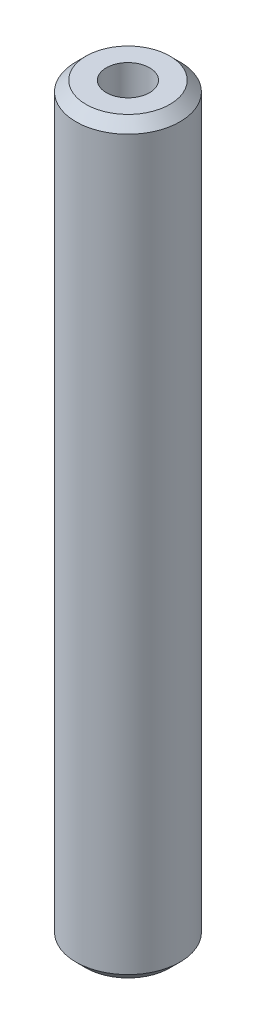
ISO-10303-21;
HEADER;
FILE_DESCRIPTION(('STEP AP214'),'2;1');
FILE_NAME('part.step','',(''),(''),'','','');
FILE_SCHEMA(('AUTOMOTIVE_DESIGN { 1 0 10303 214 1 1 1 1 }'));
ENDSEC;
DATA;
#1=APPLICATION_CONTEXT('core data for automotive mechanical design processes');
#2=APPLICATION_PROTOCOL_DEFINITION('international standard','automotive_design',2000,#1);
#3=PRODUCT_CONTEXT('',#1,'mechanical');
#4=PRODUCT('Part','Part','',(#3));
#5=PRODUCT_RELATED_PRODUCT_CATEGORY('part','',(#4));
#6=PRODUCT_DEFINITION_FORMATION('','',#4);
#7=PRODUCT_DEFINITION_CONTEXT('part definition',#1,'design');
#8=PRODUCT_DEFINITION('design','',#6,#7);
#9=PRODUCT_DEFINITION_SHAPE('','',#8);
#10=(LENGTH_UNIT() NAMED_UNIT(*) SI_UNIT(.MILLI.,.METRE.));
#11=(NAMED_UNIT(*) PLANE_ANGLE_UNIT() SI_UNIT($,.RADIAN.));
#12=(NAMED_UNIT(*) SI_UNIT($,.STERADIAN.) SOLID_ANGLE_UNIT());
#13=UNCERTAINTY_MEASURE_WITH_UNIT(LENGTH_MEASURE(1.E-05),#10,'distance_accuracy_value','');
#14=(GEOMETRIC_REPRESENTATION_CONTEXT(3) GLOBAL_UNCERTAINTY_ASSIGNED_CONTEXT((#13)) GLOBAL_UNIT_ASSIGNED_CONTEXT((#10,
#11,#12)) REPRESENTATION_CONTEXT('',''));
#15=CARTESIAN_POINT('',(0.,0.,0.));
#16=DIRECTION('',(0.,0.,1.));
#17=DIRECTION('',(1.,0.,0.));
#18=AXIS2_PLACEMENT_3D('',#15,#16,#17);
#19=CARTESIAN_POINT('',(0.,179.890282557791,0.));
#20=DIRECTION('',(0.,-1.,0.));
#21=DIRECTION('',(0.,0.,-1.));
#22=AXIS2_PLACEMENT_3D('',#19,#20,#21);
#23=CYLINDRICAL_SURFACE('',#22,12.5);
#24=CARTESIAN_POINT('',(0.,177.471475927076,0.));
#25=DIRECTION('',(0.,1.,0.));
#26=DIRECTION('',(0.,0.,1.));
#27=AXIS2_PLACEMENT_3D('',#24,#25,#26);
#28=CIRCLE('',#27,12.5);
#29=CARTESIAN_POINT('',(0.,177.471475927076,12.5));
#30=VERTEX_POINT('',#29);
#31=EDGE_CURVE('E50',#30,#30,#28,.F.);
#32=ORIENTED_EDGE('',*,*,#31,.T.);
#33=EDGE_LOOP('',(#32));
#34=FACE_BOUND('',#33,.T.);
#35=CARTESIAN_POINT('',(0.,2.4188066307152,0.));
#36=DIRECTION('',(0.,1.,0.));
#37=DIRECTION('',(0.,0.,1.));
#38=AXIS2_PLACEMENT_3D('',#35,#36,#37);
#39=CIRCLE('',#38,12.5);
#40=CARTESIAN_POINT('',(0.,2.4188066307152,12.5));
#41=VERTEX_POINT('',#40);
#42=EDGE_CURVE('E51',#41,#41,#39,.T.);
#43=ORIENTED_EDGE('',*,*,#42,.T.);
#44=EDGE_LOOP('',(#43));
#45=FACE_BOUND('',#44,.T.);
#46=ADVANCED_FACE('F39',(#34,#45),#23,.T.);
#47=CARTESIAN_POINT('',(0.,179.890282557791,0.));
#48=DIRECTION('',(0.,1.,0.));
#49=DIRECTION('',(0.,0.,1.));
#50=AXIS2_PLACEMENT_3D('',#47,#48,#49);
#51=PLANE('',#50);
#52=CARTESIAN_POINT('',(0.,179.890282557791,0.));
#53=DIRECTION('',(0.,1.,0.));
#54=DIRECTION('',(0.,0.,1.));
#55=AXIS2_PLACEMENT_3D('',#52,#53,#54);
#56=CIRCLE('',#55,10.0811933692848);
#57=CARTESIAN_POINT('',(0.,179.890282557791,10.0811933692848));
#58=VERTEX_POINT('',#57);
#59=EDGE_CURVE('E54',#58,#58,#56,.T.);
#60=ORIENTED_EDGE('',*,*,#59,.T.);
#61=EDGE_LOOP('',(#60));
#62=FACE_BOUND('',#61,.T.);
#63=CARTESIAN_POINT('',(0.,179.890282557791,0.));
#64=DIRECTION('',(0.,1.,0.));
#65=DIRECTION('',(0.,0.,1.));
#66=AXIS2_PLACEMENT_3D('',#63,#64,#65);
#67=CIRCLE('',#66,5.2029792882781);
#68=CARTESIAN_POINT('',(0.,179.890282557791,5.2029792882781));
#69=VERTEX_POINT('',#68);
#70=EDGE_CURVE('E58',#69,#69,#67,.T.);
#71=ORIENTED_EDGE('',*,*,#70,.F.);
#72=EDGE_LOOP('',(#71));
#73=FACE_BOUND('',#72,.T.);
#74=ADVANCED_FACE('F69',(#62,#73),#51,.T.);
#75=CARTESIAN_POINT('',(0.,0.,0.));
#76=DIRECTION('',(0.,1.,0.));
#77=DIRECTION('',(0.,0.,1.));
#78=AXIS2_PLACEMENT_3D('',#75,#76,#77);
#79=PLANE('',#78);
#80=CARTESIAN_POINT('',(0.,0.,0.));
#81=DIRECTION('',(0.,1.,0.));
#82=DIRECTION('',(0.,0.,1.));
#83=AXIS2_PLACEMENT_3D('',#80,#81,#82);
#84=CIRCLE('',#83,10.0811933692848);
#85=CARTESIAN_POINT('',(0.,0.,10.0811933692848));
#86=VERTEX_POINT('',#85);
#87=EDGE_CURVE('E10',#86,#86,#84,.F.);
#88=ORIENTED_EDGE('',*,*,#87,.T.);
#89=EDGE_LOOP('',(#88));
#90=FACE_BOUND('',#89,.T.);
#91=CARTESIAN_POINT('',(0.,0.,0.));
#92=DIRECTION('',(0.,1.,0.));
#93=DIRECTION('',(0.,0.,1.));
#94=AXIS2_PLACEMENT_3D('',#91,#92,#93);
#95=CIRCLE('',#94,5.2029792882781);
#96=CARTESIAN_POINT('',(0.,0.,5.2029792882781));
#97=VERTEX_POINT('',#96);
#98=EDGE_CURVE('E63',#97,#97,#95,.T.);
#99=ORIENTED_EDGE('',*,*,#98,.T.);
#100=EDGE_LOOP('',(#99));
#101=FACE_BOUND('',#100,.T.);
#102=ADVANCED_FACE('F75',(#90,#101),#79,.F.);
#103=CARTESIAN_POINT('',(0.,179.890282557791,0.));
#104=DIRECTION('',(0.,-1.,0.));
#105=DIRECTION('',(0.,0.,-1.));
#106=AXIS2_PLACEMENT_3D('',#103,#104,#105);
#107=CYLINDRICAL_SURFACE('',#106,5.2029792882781);
#108=ORIENTED_EDGE('',*,*,#70,.T.);
#109=EDGE_LOOP('',(#108));
#110=FACE_BOUND('',#109,.T.);
#111=ORIENTED_EDGE('',*,*,#98,.F.);
#112=EDGE_LOOP('',(#111));
#113=FACE_BOUND('',#112,.T.);
#114=ADVANCED_FACE('F70',(#110,#113),#107,.F.);
#115=CARTESIAN_POINT('',(0.,179.890282557791,0.));
#116=DIRECTION('',(0.,-1.,0.));
#117=DIRECTION('',(0.,0.,-1.));
#118=AXIS2_PLACEMENT_3D('',#115,#116,#117);
#119=CONICAL_SURFACE('',#118,10.0811933692848,0.785398163397446);
#120=ORIENTED_EDGE('',*,*,#31,.F.);
#121=EDGE_LOOP('',(#120));
#122=FACE_BOUND('',#121,.T.);
#123=ORIENTED_EDGE('',*,*,#59,.F.);
#124=EDGE_LOOP('',(#123));
#125=FACE_BOUND('',#124,.T.);
#126=ADVANCED_FACE('F81',(#122,#125),#119,.T.);
#127=CARTESIAN_POINT('',(0.,2.4188066307152,0.));
#128=DIRECTION('',(0.,1.,0.));
#129=DIRECTION('',(0.,0.,1.));
#130=AXIS2_PLACEMENT_3D('',#127,#128,#129);
#131=CONICAL_SURFACE('',#130,12.5,0.785398163397449);
#132=ORIENTED_EDGE('',*,*,#87,.F.);
#133=EDGE_LOOP('',(#132));
#134=FACE_BOUND('',#133,.T.);
#135=ORIENTED_EDGE('',*,*,#42,.F.);
#136=EDGE_LOOP('',(#135));
#137=FACE_BOUND('',#136,.T.);
#138=ADVANCED_FACE('F45',(#134,#137),#131,.T.);
#139=CLOSED_SHELL('',(#46,#74,#102,#114,#126,#138));
#140=MANIFOLD_SOLID_BREP('B2',#139);
#141=ADVANCED_BREP_SHAPE_REPRESENTATION('',(#18,#140),#14);
#142=SHAPE_DEFINITION_REPRESENTATION(#9,#141);
ENDSEC;
END-ISO-10303-21;
